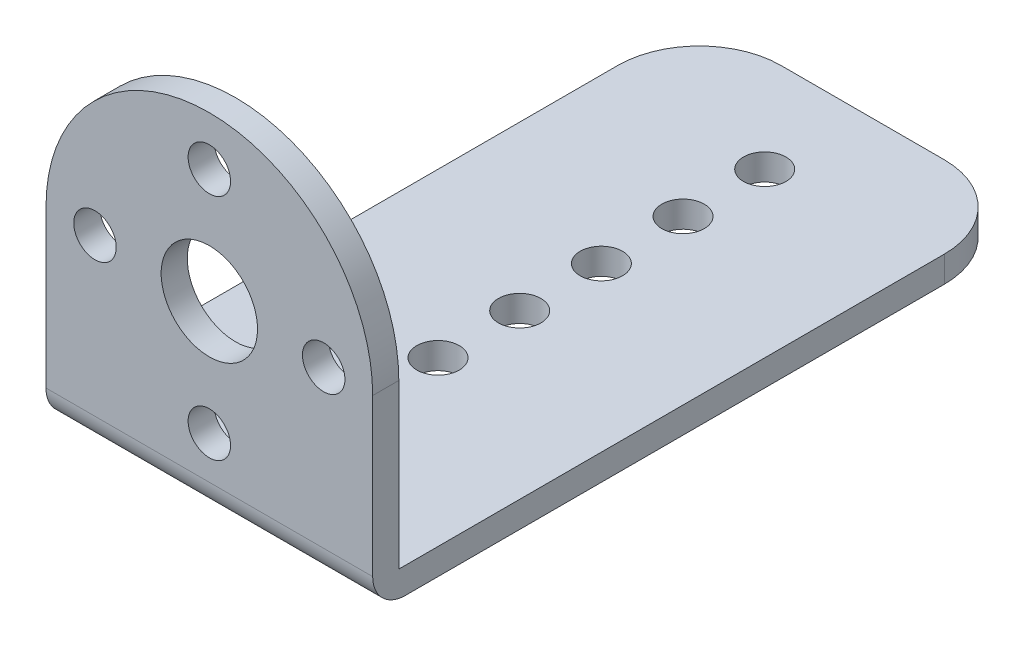
ISO-10303-21;
HEADER;
FILE_DESCRIPTION(('STEP AP214'),'2;1');
FILE_NAME('part.step','',(''),(''),'','','');
FILE_SCHEMA(('AUTOMOTIVE_DESIGN { 1 0 10303 214 1 1 1 1 }'));
ENDSEC;
DATA;
#1=APPLICATION_CONTEXT('core data for automotive mechanical design processes');
#2=APPLICATION_PROTOCOL_DEFINITION('international standard','automotive_design',2000,#1);
#3=PRODUCT_CONTEXT('',#1,'mechanical');
#4=PRODUCT('Part','Part','',(#3));
#5=PRODUCT_RELATED_PRODUCT_CATEGORY('part','',(#4));
#6=PRODUCT_DEFINITION_FORMATION('','',#4);
#7=PRODUCT_DEFINITION_CONTEXT('part definition',#1,'design');
#8=PRODUCT_DEFINITION('design','',#6,#7);
#9=PRODUCT_DEFINITION_SHAPE('','',#8);
#10=(LENGTH_UNIT() NAMED_UNIT(*) SI_UNIT(.MILLI.,.METRE.));
#11=(NAMED_UNIT(*) PLANE_ANGLE_UNIT() SI_UNIT($,.RADIAN.));
#12=(NAMED_UNIT(*) SI_UNIT($,.STERADIAN.) SOLID_ANGLE_UNIT());
#13=UNCERTAINTY_MEASURE_WITH_UNIT(LENGTH_MEASURE(1.E-05),#10,'distance_accuracy_value','');
#14=(GEOMETRIC_REPRESENTATION_CONTEXT(3) GLOBAL_UNCERTAINTY_ASSIGNED_CONTEXT((#13)) GLOBAL_UNIT_ASSIGNED_CONTEXT((#10,
#11,#12)) REPRESENTATION_CONTEXT('',''));
#15=CARTESIAN_POINT('',(0.,0.,0.));
#16=DIRECTION('',(0.,0.,1.));
#17=DIRECTION('',(1.,0.,0.));
#18=AXIS2_PLACEMENT_3D('',#15,#16,#17);
#19=CARTESIAN_POINT('',(0.,0.,-2.032));
#20=DIRECTION('',(0.,0.,1.));
#21=DIRECTION('',(1.,0.,0.));
#22=AXIS2_PLACEMENT_3D('',#19,#20,#21);
#23=PLANE('',#22);
#24=CARTESIAN_POINT('',(0.,0.,-2.032));
#25=DIRECTION('',(0.,0.,1.));
#26=DIRECTION('',(1.,0.,0.));
#27=AXIS2_PLACEMENT_3D('',#24,#25,#26);
#28=CIRCLE('',#27,3.7465);
#29=CARTESIAN_POINT('',(3.7465,0.,-2.032));
#30=VERTEX_POINT('',#29);
#31=EDGE_CURVE('E138',#30,#30,#28,.T.);
#32=ORIENTED_EDGE('',*,*,#31,.T.);
#33=EDGE_LOOP('',(#32));
#34=FACE_BOUND('',#33,.T.);
#35=CARTESIAN_POINT('',(0.,8.89,-2.032));
#36=DIRECTION('',(0.,0.,1.));
#37=DIRECTION('',(1.,0.,0.));
#38=AXIS2_PLACEMENT_3D('',#35,#36,#37);
#39=CIRCLE('',#38,1.651);
#40=CARTESIAN_POINT('',(1.651,8.89,-2.032));
#41=VERTEX_POINT('',#40);
#42=EDGE_CURVE('E285',#41,#41,#39,.T.);
#43=ORIENTED_EDGE('',*,*,#42,.T.);
#44=EDGE_LOOP('',(#43));
#45=FACE_BOUND('',#44,.T.);
#46=CARTESIAN_POINT('',(8.89,0.,-2.032));
#47=DIRECTION('',(0.,0.,1.));
#48=DIRECTION('',(1.,0.,0.));
#49=AXIS2_PLACEMENT_3D('',#46,#47,#48);
#50=CIRCLE('',#49,1.651);
#51=CARTESIAN_POINT('',(10.541,0.,-2.032));
#52=VERTEX_POINT('',#51);
#53=EDGE_CURVE('E290',#52,#52,#50,.T.);
#54=ORIENTED_EDGE('',*,*,#53,.T.);
#55=EDGE_LOOP('',(#54));
#56=FACE_BOUND('',#55,.T.);
#57=CARTESIAN_POINT('',(5.03160571663699E-13,-8.89,-2.032));
#58=DIRECTION('',(0.,0.,1.));
#59=DIRECTION('',(1.,0.,0.));
#60=AXIS2_PLACEMENT_3D('',#57,#58,#59);
#61=CIRCLE('',#60,1.65100000000054);
#62=CARTESIAN_POINT('',(1.65100000000104,-8.89,-2.032));
#63=VERTEX_POINT('',#62);
#64=EDGE_CURVE('E319',#63,#63,#61,.T.);
#65=ORIENTED_EDGE('',*,*,#64,.T.);
#66=EDGE_LOOP('',(#65));
#67=FACE_BOUND('',#66,.T.);
#68=CARTESIAN_POINT('',(-8.89,0.,-2.032));
#69=DIRECTION('',(0.,0.,1.));
#70=DIRECTION('',(1.,0.,0.));
#71=AXIS2_PLACEMENT_3D('',#68,#69,#70);
#72=CIRCLE('',#71,1.651);
#73=CARTESIAN_POINT('',(-7.239,0.,-2.032));
#74=VERTEX_POINT('',#73);
#75=EDGE_CURVE('E314',#74,#74,#72,.T.);
#76=ORIENTED_EDGE('',*,*,#75,.T.);
#77=EDGE_LOOP('',(#76));
#78=FACE_BOUND('',#77,.T.);
#79=DIRECTION('',(1.,0.,0.));
#80=VECTOR('',#79,1.);
#81=CARTESIAN_POINT('',(0.,-12.7,-2.032));
#82=LINE('',#81,#80);
#83=CARTESIAN_POINT('',(-12.7,-12.7,-2.032));
#84=VERTEX_POINT('',#83);
#85=CARTESIAN_POINT('',(12.7,-12.7,-2.032));
#86=VERTEX_POINT('',#85);
#87=EDGE_CURVE('E107',#84,#86,#82,.T.);
#88=ORIENTED_EDGE('',*,*,#87,.F.);
#89=DIRECTION('',(0.,-1.,0.));
#90=VECTOR('',#89,1.);
#91=CARTESIAN_POINT('',(-12.7,0.,-2.032));
#92=LINE('',#91,#90);
#93=CARTESIAN_POINT('',(-12.7,0.,-2.032));
#94=VERTEX_POINT('',#93);
#95=EDGE_CURVE('E118',#94,#84,#92,.T.);
#96=ORIENTED_EDGE('',*,*,#95,.F.);
#97=CARTESIAN_POINT('',(0.,0.,-2.032));
#98=DIRECTION('',(0.,0.,1.));
#99=DIRECTION('',(1.,0.,0.));
#100=AXIS2_PLACEMENT_3D('',#97,#98,#99);
#101=CIRCLE('',#100,12.7);
#102=CARTESIAN_POINT('',(12.7,0.,-2.032));
#103=VERTEX_POINT('',#102);
#104=EDGE_CURVE('E127',#103,#94,#101,.T.);
#105=ORIENTED_EDGE('',*,*,#104,.F.);
#106=DIRECTION('',(0.,1.,0.));
#107=VECTOR('',#106,1.);
#108=CARTESIAN_POINT('',(12.7,0.,-2.032));
#109=LINE('',#108,#107);
#110=EDGE_CURVE('E120',#86,#103,#109,.T.);
#111=ORIENTED_EDGE('',*,*,#110,.F.);
#112=EDGE_LOOP('',(#88,#96,#105,#111));
#113=FACE_BOUND('',#112,.T.);
#114=ADVANCED_FACE('F33',(#34,#45,#56,#67,#78,#113),#23,.F.);
#115=CARTESIAN_POINT('',(0.,0.,-2.032));
#116=DIRECTION('',(0.,0.,1.));
#117=DIRECTION('',(1.,0.,0.));
#118=AXIS2_PLACEMENT_3D('',#115,#116,#117);
#119=CYLINDRICAL_SURFACE('',#118,12.7);
#120=CARTESIAN_POINT('',(0.,0.,0.));
#121=DIRECTION('',(0.,0.,1.));
#122=DIRECTION('',(1.,0.,0.));
#123=AXIS2_PLACEMENT_3D('',#120,#121,#122);
#124=CIRCLE('',#123,12.7);
#125=CARTESIAN_POINT('',(12.7,0.,0.));
#126=VERTEX_POINT('',#125);
#127=CARTESIAN_POINT('',(-12.7,0.,0.));
#128=VERTEX_POINT('',#127);
#129=EDGE_CURVE('E134',#126,#128,#124,.T.);
#130=ORIENTED_EDGE('',*,*,#129,.F.);
#131=DIRECTION('',(0.,0.,1.));
#132=VECTOR('',#131,1.);
#133=CARTESIAN_POINT('',(12.7,0.,-2.032));
#134=LINE('',#133,#132);
#135=EDGE_CURVE('E142',#103,#126,#134,.T.);
#136=ORIENTED_EDGE('',*,*,#135,.F.);
#137=ORIENTED_EDGE('',*,*,#104,.T.);
#138=DIRECTION('',(0.,0.,1.));
#139=VECTOR('',#138,1.);
#140=CARTESIAN_POINT('',(-12.7,0.,-2.032));
#141=LINE('',#140,#139);
#142=EDGE_CURVE('E126',#94,#128,#141,.T.);
#143=ORIENTED_EDGE('',*,*,#142,.T.);
#144=EDGE_LOOP('',(#130,#136,#137,#143));
#145=FACE_BOUND('',#144,.T.);
#146=ADVANCED_FACE('F199',(#145),#119,.T.);
#147=CARTESIAN_POINT('',(12.7,0.,-2.032));
#148=DIRECTION('',(1.,0.,0.));
#149=DIRECTION('',(0.,0.,-1.));
#150=AXIS2_PLACEMENT_3D('',#147,#148,#149);
#151=PLANE('',#150);
#152=DIRECTION('',(0.,0.,1.));
#153=VECTOR('',#152,1.);
#154=CARTESIAN_POINT('',(12.7,-14.732,-2.032));
#155=LINE('',#154,#153);
#156=CARTESIAN_POINT('',(12.7,-14.732,-44.45));
#157=VERTEX_POINT('',#156);
#158=CARTESIAN_POINT('',(12.7,-14.732,-2.54));
#159=VERTEX_POINT('',#158);
#160=EDGE_CURVE('E146',#157,#159,#155,.T.);
#161=ORIENTED_EDGE('',*,*,#160,.F.);
#162=DIRECTION('',(0.,-1.,0.));
#163=VECTOR('',#162,1.);
#164=CARTESIAN_POINT('',(12.7,0.,-44.45));
#165=LINE('',#164,#163);
#166=CARTESIAN_POINT('',(12.7,-12.7,-44.45));
#167=VERTEX_POINT('',#166);
#168=EDGE_CURVE('E56',#157,#167,#165,.F.);
#169=ORIENTED_EDGE('',*,*,#168,.T.);
#170=DIRECTION('',(0.,0.,1.));
#171=VECTOR('',#170,1.);
#172=CARTESIAN_POINT('',(12.7,-12.7,0.));
#173=LINE('',#172,#171);
#174=EDGE_CURVE('E122',#167,#86,#173,.T.);
#175=ORIENTED_EDGE('',*,*,#174,.T.);
#176=ORIENTED_EDGE('',*,*,#110,.T.);
#177=ORIENTED_EDGE('',*,*,#135,.T.);
#178=DIRECTION('',(0.,1.,0.));
#179=VECTOR('',#178,1.);
#180=CARTESIAN_POINT('',(12.7,0.,0.));
#181=LINE('',#180,#179);
#182=CARTESIAN_POINT('',(12.7,-12.192,0.));
#183=VERTEX_POINT('',#182);
#184=EDGE_CURVE('E130',#183,#126,#181,.T.);
#185=ORIENTED_EDGE('',*,*,#184,.F.);
#186=CARTESIAN_POINT('',(12.7,-12.192,-2.54));
#187=DIRECTION('',(1.,0.,0.));
#188=DIRECTION('',(0.,0.,-1.));
#189=AXIS2_PLACEMENT_3D('',#186,#187,#188);
#190=CIRCLE('',#189,2.54);
#191=EDGE_CURVE('E153',#183,#159,#190,.T.);
#192=ORIENTED_EDGE('',*,*,#191,.T.);
#193=EDGE_LOOP('',(#161,#169,#175,#176,#177,#185,#192));
#194=FACE_BOUND('',#193,.T.);
#195=ADVANCED_FACE('F185',(#194),#151,.T.);
#196=CARTESIAN_POINT('',(-12.7,-14.732,-2.032));
#197=DIRECTION('',(0.,-1.,0.));
#198=DIRECTION('',(0.,0.,-1.));
#199=AXIS2_PLACEMENT_3D('',#196,#197,#198);
#200=PLANE('',#199);
#201=DIRECTION('',(1.,0.,0.));
#202=VECTOR('',#201,1.);
#203=CARTESIAN_POINT('',(-12.7,-14.732,-50.8));
#204=LINE('',#203,#202);
#205=CARTESIAN_POINT('',(-6.35,-14.732,-50.8));
#206=VERTEX_POINT('',#205);
#207=CARTESIAN_POINT('',(6.35,-14.732,-50.8));
#208=VERTEX_POINT('',#207);
#209=EDGE_CURVE('E113',#206,#208,#204,.T.);
#210=ORIENTED_EDGE('',*,*,#209,.T.);
#211=CARTESIAN_POINT('',(6.35,-14.732,-44.45));
#212=DIRECTION('',(0.,-1.,0.));
#213=DIRECTION('',(0.,0.,-1.));
#214=AXIS2_PLACEMENT_3D('',#211,#212,#213);
#215=CIRCLE('',#214,6.35);
#216=EDGE_CURVE('E168',#208,#157,#215,.T.);
#217=ORIENTED_EDGE('',*,*,#216,.T.);
#218=ORIENTED_EDGE('',*,*,#160,.T.);
#219=DIRECTION('',(1.,0.,0.));
#220=VECTOR('',#219,1.);
#221=CARTESIAN_POINT('',(-12.7,-14.732,-2.54));
#222=LINE('',#221,#220);
#223=CARTESIAN_POINT('',(-12.7,-14.732,-2.54));
#224=VERTEX_POINT('',#223);
#225=EDGE_CURVE('E156',#159,#224,#222,.F.);
#226=ORIENTED_EDGE('',*,*,#225,.T.);
#227=DIRECTION('',(0.,0.,1.));
#228=VECTOR('',#227,1.);
#229=CARTESIAN_POINT('',(-12.7,-14.732,-2.032));
#230=LINE('',#229,#228);
#231=CARTESIAN_POINT('',(-12.7,-14.732,-44.45));
#232=VERTEX_POINT('',#231);
#233=EDGE_CURVE('E148',#232,#224,#230,.T.);
#234=ORIENTED_EDGE('',*,*,#233,.F.);
#235=CARTESIAN_POINT('',(-6.35,-14.732,-44.45));
#236=DIRECTION('',(0.,-1.,0.));
#237=DIRECTION('',(0.,0.,-1.));
#238=AXIS2_PLACEMENT_3D('',#235,#236,#237);
#239=CIRCLE('',#238,6.35);
#240=EDGE_CURVE('E166',#232,#206,#239,.T.);
#241=ORIENTED_EDGE('',*,*,#240,.T.);
#242=EDGE_LOOP('',(#210,#217,#218,#226,#234,#241));
#243=FACE_BOUND('',#242,.T.);
#244=CARTESIAN_POINT('',(0.,-14.732,-43.18));
#245=DIRECTION('',(0.,-1.,0.));
#246=DIRECTION('',(0.,0.,-1.));
#247=AXIS2_PLACEMENT_3D('',#244,#245,#246);
#248=CIRCLE('',#247,1.651);
#249=CARTESIAN_POINT('',(0.,-14.732,-44.831));
#250=VERTEX_POINT('',#249);
#251=EDGE_CURVE('E332',#250,#250,#248,.T.);
#252=ORIENTED_EDGE('',*,*,#251,.F.);
#253=EDGE_LOOP('',(#252));
#254=FACE_BOUND('',#253,.T.);
#255=CARTESIAN_POINT('',(0.,-14.732,-36.83));
#256=DIRECTION('',(0.,-1.,0.));
#257=DIRECTION('',(0.,0.,-1.));
#258=AXIS2_PLACEMENT_3D('',#255,#256,#257);
#259=CIRCLE('',#258,1.651);
#260=CARTESIAN_POINT('',(0.,-14.732,-38.481));
#261=VERTEX_POINT('',#260);
#262=EDGE_CURVE('E338',#261,#261,#259,.T.);
#263=ORIENTED_EDGE('',*,*,#262,.F.);
#264=EDGE_LOOP('',(#263));
#265=FACE_BOUND('',#264,.T.);
#266=CARTESIAN_POINT('',(0.,-14.732,-30.48));
#267=DIRECTION('',(0.,-1.,0.));
#268=DIRECTION('',(0.,0.,-1.));
#269=AXIS2_PLACEMENT_3D('',#266,#267,#268);
#270=CIRCLE('',#269,1.651);
#271=CARTESIAN_POINT('',(0.,-14.732,-32.131));
#272=VERTEX_POINT('',#271);
#273=EDGE_CURVE('E344',#272,#272,#270,.T.);
#274=ORIENTED_EDGE('',*,*,#273,.F.);
#275=EDGE_LOOP('',(#274));
#276=FACE_BOUND('',#275,.T.);
#277=CARTESIAN_POINT('',(0.,-14.732,-24.13));
#278=DIRECTION('',(0.,-1.,0.));
#279=DIRECTION('',(0.,0.,-1.));
#280=AXIS2_PLACEMENT_3D('',#277,#278,#279);
#281=CIRCLE('',#280,1.651);
#282=CARTESIAN_POINT('',(0.,-14.732,-25.781));
#283=VERTEX_POINT('',#282);
#284=EDGE_CURVE('E350',#283,#283,#281,.T.);
#285=ORIENTED_EDGE('',*,*,#284,.F.);
#286=EDGE_LOOP('',(#285));
#287=FACE_BOUND('',#286,.T.);
#288=CARTESIAN_POINT('',(0.,-14.732,-17.78));
#289=DIRECTION('',(0.,-1.,0.));
#290=DIRECTION('',(0.,0.,-1.));
#291=AXIS2_PLACEMENT_3D('',#288,#289,#290);
#292=CIRCLE('',#291,1.651);
#293=CARTESIAN_POINT('',(0.,-14.732,-19.431));
#294=VERTEX_POINT('',#293);
#295=EDGE_CURVE('E356',#294,#294,#292,.T.);
#296=ORIENTED_EDGE('',*,*,#295,.F.);
#297=EDGE_LOOP('',(#296));
#298=FACE_BOUND('',#297,.T.);
#299=CARTESIAN_POINT('',(0.,-14.732,-11.43));
#300=DIRECTION('',(0.,-1.,0.));
#301=DIRECTION('',(0.,0.,-1.));
#302=AXIS2_PLACEMENT_3D('',#299,#300,#301);
#303=CIRCLE('',#302,1.651);
#304=CARTESIAN_POINT('',(0.,-14.732,-13.081));
#305=VERTEX_POINT('',#304);
#306=EDGE_CURVE('E362',#305,#305,#303,.T.);
#307=ORIENTED_EDGE('',*,*,#306,.F.);
#308=EDGE_LOOP('',(#307));
#309=FACE_BOUND('',#308,.T.);
#310=CARTESIAN_POINT('',(-1.02180915128385E-13,-14.732,-5.07999999999999));
#311=DIRECTION('',(0.,-1.,0.));
#312=DIRECTION('',(0.,0.,-1.));
#313=AXIS2_PLACEMENT_3D('',#310,#311,#312);
#314=CIRCLE('',#313,1.651);
#315=CARTESIAN_POINT('',(-1.02180915128385E-13,-14.732,-6.73099999999999));
#316=VERTEX_POINT('',#315);
#317=EDGE_CURVE('E368',#316,#316,#314,.T.);
#318=ORIENTED_EDGE('',*,*,#317,.F.);
#319=EDGE_LOOP('',(#318));
#320=FACE_BOUND('',#319,.T.);
#321=ADVANCED_FACE('F183',(#243,#254,#265,#276,#287,#298,#309,#320),#200,.T.);
#322=CARTESIAN_POINT('',(-12.7,0.,-2.032));
#323=DIRECTION('',(-1.,0.,0.));
#324=DIRECTION('',(0.,-1.,0.));
#325=AXIS2_PLACEMENT_3D('',#322,#323,#324);
#326=PLANE('',#325);
#327=DIRECTION('',(0.,0.,-1.));
#328=VECTOR('',#327,1.);
#329=CARTESIAN_POINT('',(-12.7,-12.7,0.));
#330=LINE('',#329,#328);
#331=CARTESIAN_POINT('',(-12.7,-12.7,-44.45));
#332=VERTEX_POINT('',#331);
#333=EDGE_CURVE('E104',#84,#332,#330,.T.);
#334=ORIENTED_EDGE('',*,*,#333,.T.);
#335=DIRECTION('',(0.,-1.,0.));
#336=VECTOR('',#335,1.);
#337=CARTESIAN_POINT('',(-12.7,0.,-44.45));
#338=LINE('',#337,#336);
#339=EDGE_CURVE('E11',#332,#232,#338,.T.);
#340=ORIENTED_EDGE('',*,*,#339,.T.);
#341=ORIENTED_EDGE('',*,*,#233,.T.);
#342=CARTESIAN_POINT('',(-12.7,-12.192,-2.54));
#343=DIRECTION('',(-1.,0.,0.));
#344=DIRECTION('',(0.,-1.,0.));
#345=AXIS2_PLACEMENT_3D('',#342,#343,#344);
#346=CIRCLE('',#345,2.54);
#347=CARTESIAN_POINT('',(-12.7,-12.192,0.));
#348=VERTEX_POINT('',#347);
#349=EDGE_CURVE('E159',#224,#348,#346,.T.);
#350=ORIENTED_EDGE('',*,*,#349,.T.);
#351=DIRECTION('',(0.,-1.,0.));
#352=VECTOR('',#351,1.);
#353=CARTESIAN_POINT('',(-12.7,0.,0.));
#354=LINE('',#353,#352);
#355=EDGE_CURVE('E137',#128,#348,#354,.T.);
#356=ORIENTED_EDGE('',*,*,#355,.F.);
#357=ORIENTED_EDGE('',*,*,#142,.F.);
#358=ORIENTED_EDGE('',*,*,#95,.T.);
#359=EDGE_LOOP('',(#334,#340,#341,#350,#356,#357,#358));
#360=FACE_BOUND('',#359,.T.);
#361=ADVANCED_FACE('F124',(#360),#326,.T.);
#362=CARTESIAN_POINT('',(0.,0.,0.));
#363=DIRECTION('',(0.,0.,1.));
#364=DIRECTION('',(1.,0.,0.));
#365=AXIS2_PLACEMENT_3D('',#362,#363,#364);
#366=PLANE('',#365);
#367=ORIENTED_EDGE('',*,*,#355,.T.);
#368=DIRECTION('',(1.,0.,0.));
#369=VECTOR('',#368,1.);
#370=CARTESIAN_POINT('',(0.,-12.192,0.));
#371=LINE('',#370,#369);
#372=EDGE_CURVE('E145',#348,#183,#371,.T.);
#373=ORIENTED_EDGE('',*,*,#372,.T.);
#374=ORIENTED_EDGE('',*,*,#184,.T.);
#375=ORIENTED_EDGE('',*,*,#129,.T.);
#376=EDGE_LOOP('',(#367,#373,#374,#375));
#377=FACE_BOUND('',#376,.T.);
#378=CARTESIAN_POINT('',(0.,0.,0.));
#379=DIRECTION('',(0.,0.,1.));
#380=DIRECTION('',(1.,0.,0.));
#381=AXIS2_PLACEMENT_3D('',#378,#379,#380);
#382=CIRCLE('',#381,3.7465);
#383=CARTESIAN_POINT('',(3.7465,0.,0.));
#384=VERTEX_POINT('',#383);
#385=EDGE_CURVE('E292',#384,#384,#382,.T.);
#386=ORIENTED_EDGE('',*,*,#385,.F.);
#387=EDGE_LOOP('',(#386));
#388=FACE_BOUND('',#387,.T.);
#389=CARTESIAN_POINT('',(0.,8.89,0.));
#390=DIRECTION('',(0.,0.,1.));
#391=DIRECTION('',(1.,0.,0.));
#392=AXIS2_PLACEMENT_3D('',#389,#390,#391);
#393=CIRCLE('',#392,1.651);
#394=CARTESIAN_POINT('',(1.651,8.89,0.));
#395=VERTEX_POINT('',#394);
#396=EDGE_CURVE('E288',#395,#395,#393,.T.);
#397=ORIENTED_EDGE('',*,*,#396,.F.);
#398=EDGE_LOOP('',(#397));
#399=FACE_BOUND('',#398,.T.);
#400=CARTESIAN_POINT('',(8.89,0.,0.));
#401=DIRECTION('',(0.,0.,1.));
#402=DIRECTION('',(1.,0.,0.));
#403=AXIS2_PLACEMENT_3D('',#400,#401,#402);
#404=CIRCLE('',#403,1.651);
#405=CARTESIAN_POINT('',(10.541,0.,0.));
#406=VERTEX_POINT('',#405);
#407=EDGE_CURVE('E295',#406,#406,#404,.T.);
#408=ORIENTED_EDGE('',*,*,#407,.F.);
#409=EDGE_LOOP('',(#408));
#410=FACE_BOUND('',#409,.T.);
#411=CARTESIAN_POINT('',(5.03160571663699E-13,-8.89,0.));
#412=DIRECTION('',(0.,0.,1.));
#413=DIRECTION('',(1.,0.,0.));
#414=AXIS2_PLACEMENT_3D('',#411,#412,#413);
#415=CIRCLE('',#414,1.65100000000054);
#416=CARTESIAN_POINT('',(1.65100000000104,-8.89,0.));
#417=VERTEX_POINT('',#416);
#418=EDGE_CURVE('E310',#417,#417,#415,.T.);
#419=ORIENTED_EDGE('',*,*,#418,.F.);
#420=EDGE_LOOP('',(#419));
#421=FACE_BOUND('',#420,.T.);
#422=CARTESIAN_POINT('',(-8.89,0.,0.));
#423=DIRECTION('',(0.,0.,1.));
#424=DIRECTION('',(1.,0.,0.));
#425=AXIS2_PLACEMENT_3D('',#422,#423,#424);
#426=CIRCLE('',#425,1.651);
#427=CARTESIAN_POINT('',(-7.239,0.,0.));
#428=VERTEX_POINT('',#427);
#429=EDGE_CURVE('E121',#428,#428,#426,.T.);
#430=ORIENTED_EDGE('',*,*,#429,.F.);
#431=EDGE_LOOP('',(#430));
#432=FACE_BOUND('',#431,.T.);
#433=ADVANCED_FACE('F213',(#377,#388,#399,#410,#421,#432),#366,.T.);
#434=CARTESIAN_POINT('',(0.,0.,-2.032));
#435=DIRECTION('',(0.,0.,1.));
#436=DIRECTION('',(1.,0.,0.));
#437=AXIS2_PLACEMENT_3D('',#434,#435,#436);
#438=CYLINDRICAL_SURFACE('',#437,3.7465);
#439=ORIENTED_EDGE('',*,*,#31,.F.);
#440=EDGE_LOOP('',(#439));
#441=FACE_BOUND('',#440,.T.);
#442=ORIENTED_EDGE('',*,*,#385,.T.);
#443=EDGE_LOOP('',(#442));
#444=FACE_BOUND('',#443,.T.);
#445=ADVANCED_FACE('F211',(#441,#444),#438,.F.);
#446=CARTESIAN_POINT('',(0.,8.89,-2.032));
#447=DIRECTION('',(0.,0.,1.));
#448=DIRECTION('',(1.,0.,0.));
#449=AXIS2_PLACEMENT_3D('',#446,#447,#448);
#450=CYLINDRICAL_SURFACE('',#449,1.651);
#451=ORIENTED_EDGE('',*,*,#42,.F.);
#452=EDGE_LOOP('',(#451));
#453=FACE_BOUND('',#452,.T.);
#454=ORIENTED_EDGE('',*,*,#396,.T.);
#455=EDGE_LOOP('',(#454));
#456=FACE_BOUND('',#455,.T.);
#457=ADVANCED_FACE('F274',(#453,#456),#450,.F.);
#458=CARTESIAN_POINT('',(8.89,0.,-2.032));
#459=DIRECTION('',(0.,0.,1.));
#460=DIRECTION('',(1.,0.,0.));
#461=AXIS2_PLACEMENT_3D('',#458,#459,#460);
#462=CYLINDRICAL_SURFACE('',#461,1.651);
#463=ORIENTED_EDGE('',*,*,#53,.F.);
#464=EDGE_LOOP('',(#463));
#465=FACE_BOUND('',#464,.T.);
#466=ORIENTED_EDGE('',*,*,#407,.T.);
#467=EDGE_LOOP('',(#466));
#468=FACE_BOUND('',#467,.T.);
#469=ADVANCED_FACE('F271',(#465,#468),#462,.F.);
#470=CARTESIAN_POINT('',(5.03160571663699E-13,-8.89,-2.032));
#471=DIRECTION('',(0.,0.,1.));
#472=DIRECTION('',(1.,0.,0.));
#473=AXIS2_PLACEMENT_3D('',#470,#471,#472);
#474=CYLINDRICAL_SURFACE('',#473,1.65100000000054);
#475=ORIENTED_EDGE('',*,*,#64,.F.);
#476=EDGE_LOOP('',(#475));
#477=FACE_BOUND('',#476,.T.);
#478=ORIENTED_EDGE('',*,*,#418,.T.);
#479=EDGE_LOOP('',(#478));
#480=FACE_BOUND('',#479,.T.);
#481=ADVANCED_FACE('F267',(#477,#480),#474,.F.);
#482=CARTESIAN_POINT('',(-8.89,0.,-2.032));
#483=DIRECTION('',(0.,0.,1.));
#484=DIRECTION('',(1.,0.,0.));
#485=AXIS2_PLACEMENT_3D('',#482,#483,#484);
#486=CYLINDRICAL_SURFACE('',#485,1.651);
#487=ORIENTED_EDGE('',*,*,#75,.F.);
#488=EDGE_LOOP('',(#487));
#489=FACE_BOUND('',#488,.T.);
#490=ORIENTED_EDGE('',*,*,#429,.T.);
#491=EDGE_LOOP('',(#490));
#492=FACE_BOUND('',#491,.T.);
#493=ADVANCED_FACE('F261',(#489,#492),#486,.F.);
#494=CARTESIAN_POINT('',(0.,-12.7,0.));
#495=DIRECTION('',(0.,-1.,0.));
#496=DIRECTION('',(0.,0.,-1.));
#497=AXIS2_PLACEMENT_3D('',#494,#495,#496);
#498=PLANE('',#497);
#499=CARTESIAN_POINT('',(0.,-12.7,-43.18));
#500=DIRECTION('',(0.,-1.,0.));
#501=DIRECTION('',(0.,0.,-1.));
#502=AXIS2_PLACEMENT_3D('',#499,#500,#501);
#503=CIRCLE('',#502,1.651);
#504=CARTESIAN_POINT('',(0.,-12.7,-44.831));
#505=VERTEX_POINT('',#504);
#506=EDGE_CURVE('E330',#505,#505,#503,.T.);
#507=ORIENTED_EDGE('',*,*,#506,.T.);
#508=EDGE_LOOP('',(#507));
#509=FACE_BOUND('',#508,.T.);
#510=CARTESIAN_POINT('',(0.,-12.7,-36.83));
#511=DIRECTION('',(0.,-1.,0.));
#512=DIRECTION('',(0.,0.,-1.));
#513=AXIS2_PLACEMENT_3D('',#510,#511,#512);
#514=CIRCLE('',#513,1.651);
#515=CARTESIAN_POINT('',(0.,-12.7,-38.481));
#516=VERTEX_POINT('',#515);
#517=EDGE_CURVE('E335',#516,#516,#514,.T.);
#518=ORIENTED_EDGE('',*,*,#517,.T.);
#519=EDGE_LOOP('',(#518));
#520=FACE_BOUND('',#519,.T.);
#521=CARTESIAN_POINT('',(0.,-12.7,-30.48));
#522=DIRECTION('',(0.,-1.,0.));
#523=DIRECTION('',(0.,0.,-1.));
#524=AXIS2_PLACEMENT_3D('',#521,#522,#523);
#525=CIRCLE('',#524,1.651);
#526=CARTESIAN_POINT('',(0.,-12.7,-32.131));
#527=VERTEX_POINT('',#526);
#528=EDGE_CURVE('E341',#527,#527,#525,.T.);
#529=ORIENTED_EDGE('',*,*,#528,.T.);
#530=EDGE_LOOP('',(#529));
#531=FACE_BOUND('',#530,.T.);
#532=CARTESIAN_POINT('',(0.,-12.7,-24.13));
#533=DIRECTION('',(0.,-1.,0.));
#534=DIRECTION('',(0.,0.,-1.));
#535=AXIS2_PLACEMENT_3D('',#532,#533,#534);
#536=CIRCLE('',#535,1.651);
#537=CARTESIAN_POINT('',(0.,-12.7,-25.781));
#538=VERTEX_POINT('',#537);
#539=EDGE_CURVE('E347',#538,#538,#536,.T.);
#540=ORIENTED_EDGE('',*,*,#539,.T.);
#541=EDGE_LOOP('',(#540));
#542=FACE_BOUND('',#541,.T.);
#543=CARTESIAN_POINT('',(0.,-12.7,-17.78));
#544=DIRECTION('',(0.,-1.,0.));
#545=DIRECTION('',(0.,0.,-1.));
#546=AXIS2_PLACEMENT_3D('',#543,#544,#545);
#547=CIRCLE('',#546,1.651);
#548=CARTESIAN_POINT('',(0.,-12.7,-19.431));
#549=VERTEX_POINT('',#548);
#550=EDGE_CURVE('E353',#549,#549,#547,.T.);
#551=ORIENTED_EDGE('',*,*,#550,.T.);
#552=EDGE_LOOP('',(#551));
#553=FACE_BOUND('',#552,.T.);
#554=CARTESIAN_POINT('',(0.,-12.7,-11.43));
#555=DIRECTION('',(0.,-1.,0.));
#556=DIRECTION('',(0.,0.,-1.));
#557=AXIS2_PLACEMENT_3D('',#554,#555,#556);
#558=CIRCLE('',#557,1.651);
#559=CARTESIAN_POINT('',(0.,-12.7,-13.081));
#560=VERTEX_POINT('',#559);
#561=EDGE_CURVE('E359',#560,#560,#558,.T.);
#562=ORIENTED_EDGE('',*,*,#561,.T.);
#563=EDGE_LOOP('',(#562));
#564=FACE_BOUND('',#563,.T.);
#565=CARTESIAN_POINT('',(-1.02180915128385E-13,-12.7,-5.07999999999999));
#566=DIRECTION('',(0.,-1.,0.));
#567=DIRECTION('',(0.,0.,-1.));
#568=AXIS2_PLACEMENT_3D('',#565,#566,#567);
#569=CIRCLE('',#568,1.651);
#570=CARTESIAN_POINT('',(-1.02180915128385E-13,-12.7,-6.73099999999999));
#571=VERTEX_POINT('',#570);
#572=EDGE_CURVE('E365',#571,#571,#569,.T.);
#573=ORIENTED_EDGE('',*,*,#572,.T.);
#574=EDGE_LOOP('',(#573));
#575=FACE_BOUND('',#574,.T.);
#576=ORIENTED_EDGE('',*,*,#174,.F.);
#577=CARTESIAN_POINT('',(6.35,-12.7,-44.45));
#578=DIRECTION('',(0.,-1.,0.));
#579=DIRECTION('',(0.,0.,-1.));
#580=AXIS2_PLACEMENT_3D('',#577,#578,#579);
#581=CIRCLE('',#580,6.35);
#582=CARTESIAN_POINT('',(6.35,-12.7,-50.8));
#583=VERTEX_POINT('',#582);
#584=EDGE_CURVE('E41',#167,#583,#581,.F.);
#585=ORIENTED_EDGE('',*,*,#584,.T.);
#586=DIRECTION('',(1.,0.,0.));
#587=VECTOR('',#586,1.);
#588=CARTESIAN_POINT('',(-12.7,-12.7,-50.8));
#589=LINE('',#588,#587);
#590=CARTESIAN_POINT('',(-6.35,-12.7,-50.8));
#591=VERTEX_POINT('',#590);
#592=EDGE_CURVE('E112',#591,#583,#589,.T.);
#593=ORIENTED_EDGE('',*,*,#592,.F.);
#594=CARTESIAN_POINT('',(-6.35,-12.7,-44.45));
#595=DIRECTION('',(0.,-1.,0.));
#596=DIRECTION('',(0.,0.,-1.));
#597=AXIS2_PLACEMENT_3D('',#594,#595,#596);
#598=CIRCLE('',#597,6.35);
#599=EDGE_CURVE('E48',#591,#332,#598,.F.);
#600=ORIENTED_EDGE('',*,*,#599,.T.);
#601=ORIENTED_EDGE('',*,*,#333,.F.);
#602=ORIENTED_EDGE('',*,*,#87,.T.);
#603=EDGE_LOOP('',(#576,#585,#593,#600,#601,#602));
#604=FACE_BOUND('',#603,.T.);
#605=ADVANCED_FACE('F106',(#509,#520,#531,#542,#553,#564,#575,#604),#498,.F.);
#606=CARTESIAN_POINT('',(-12.7,-12.7,-50.8));
#607=DIRECTION('',(0.,0.,-1.));
#608=DIRECTION('',(-1.,0.,0.));
#609=AXIS2_PLACEMENT_3D('',#606,#607,#608);
#610=PLANE('',#609);
#611=ORIENTED_EDGE('',*,*,#592,.T.);
#612=DIRECTION('',(0.,-1.,0.));
#613=VECTOR('',#612,1.);
#614=CARTESIAN_POINT('',(6.35,-12.7,-50.8));
#615=LINE('',#614,#613);
#616=EDGE_CURVE('E163',#583,#208,#615,.T.);
#617=ORIENTED_EDGE('',*,*,#616,.T.);
#618=ORIENTED_EDGE('',*,*,#209,.F.);
#619=DIRECTION('',(0.,-1.,0.));
#620=VECTOR('',#619,1.);
#621=CARTESIAN_POINT('',(-6.35,-12.7,-50.8));
#622=LINE('',#621,#620);
#623=EDGE_CURVE('E161',#206,#591,#622,.F.);
#624=ORIENTED_EDGE('',*,*,#623,.T.);
#625=EDGE_LOOP('',(#611,#617,#618,#624));
#626=FACE_BOUND('',#625,.T.);
#627=ADVANCED_FACE('F176',(#626),#610,.T.);
#628=CARTESIAN_POINT('',(0.,-12.7,-43.18));
#629=DIRECTION('',(0.,-1.,0.));
#630=DIRECTION('',(0.,0.,-1.));
#631=AXIS2_PLACEMENT_3D('',#628,#629,#630);
#632=CYLINDRICAL_SURFACE('',#631,1.651);
#633=ORIENTED_EDGE('',*,*,#506,.F.);
#634=EDGE_LOOP('',(#633));
#635=FACE_BOUND('',#634,.T.);
#636=ORIENTED_EDGE('',*,*,#251,.T.);
#637=EDGE_LOOP('',(#636));
#638=FACE_BOUND('',#637,.T.);
#639=ADVANCED_FACE('F254',(#635,#638),#632,.F.);
#640=CARTESIAN_POINT('',(0.,-12.7,-36.83));
#641=DIRECTION('',(0.,-1.,0.));
#642=DIRECTION('',(0.,0.,-1.));
#643=AXIS2_PLACEMENT_3D('',#640,#641,#642);
#644=CYLINDRICAL_SURFACE('',#643,1.651);
#645=ORIENTED_EDGE('',*,*,#517,.F.);
#646=EDGE_LOOP('',(#645));
#647=FACE_BOUND('',#646,.T.);
#648=ORIENTED_EDGE('',*,*,#262,.T.);
#649=EDGE_LOOP('',(#648));
#650=FACE_BOUND('',#649,.T.);
#651=ADVANCED_FACE('F250',(#647,#650),#644,.F.);
#652=CARTESIAN_POINT('',(0.,-12.7,-30.48));
#653=DIRECTION('',(0.,-1.,0.));
#654=DIRECTION('',(0.,0.,-1.));
#655=AXIS2_PLACEMENT_3D('',#652,#653,#654);
#656=CYLINDRICAL_SURFACE('',#655,1.651);
#657=ORIENTED_EDGE('',*,*,#528,.F.);
#658=EDGE_LOOP('',(#657));
#659=FACE_BOUND('',#658,.T.);
#660=ORIENTED_EDGE('',*,*,#273,.T.);
#661=EDGE_LOOP('',(#660));
#662=FACE_BOUND('',#661,.T.);
#663=ADVANCED_FACE('F246',(#659,#662),#656,.F.);
#664=CARTESIAN_POINT('',(0.,-12.7,-24.13));
#665=DIRECTION('',(0.,-1.,0.));
#666=DIRECTION('',(0.,0.,-1.));
#667=AXIS2_PLACEMENT_3D('',#664,#665,#666);
#668=CYLINDRICAL_SURFACE('',#667,1.651);
#669=ORIENTED_EDGE('',*,*,#539,.F.);
#670=EDGE_LOOP('',(#669));
#671=FACE_BOUND('',#670,.T.);
#672=ORIENTED_EDGE('',*,*,#284,.T.);
#673=EDGE_LOOP('',(#672));
#674=FACE_BOUND('',#673,.T.);
#675=ADVANCED_FACE('F242',(#671,#674),#668,.F.);
#676=CARTESIAN_POINT('',(0.,-12.7,-17.78));
#677=DIRECTION('',(0.,-1.,0.));
#678=DIRECTION('',(0.,0.,-1.));
#679=AXIS2_PLACEMENT_3D('',#676,#677,#678);
#680=CYLINDRICAL_SURFACE('',#679,1.651);
#681=ORIENTED_EDGE('',*,*,#550,.F.);
#682=EDGE_LOOP('',(#681));
#683=FACE_BOUND('',#682,.T.);
#684=ORIENTED_EDGE('',*,*,#295,.T.);
#685=EDGE_LOOP('',(#684));
#686=FACE_BOUND('',#685,.T.);
#687=ADVANCED_FACE('F234',(#683,#686),#680,.F.);
#688=CARTESIAN_POINT('',(0.,-12.7,-11.43));
#689=DIRECTION('',(0.,-1.,0.));
#690=DIRECTION('',(0.,0.,-1.));
#691=AXIS2_PLACEMENT_3D('',#688,#689,#690);
#692=CYLINDRICAL_SURFACE('',#691,1.651);
#693=ORIENTED_EDGE('',*,*,#561,.F.);
#694=EDGE_LOOP('',(#693));
#695=FACE_BOUND('',#694,.T.);
#696=ORIENTED_EDGE('',*,*,#306,.T.);
#697=EDGE_LOOP('',(#696));
#698=FACE_BOUND('',#697,.T.);
#699=ADVANCED_FACE('F228',(#695,#698),#692,.F.);
#700=CARTESIAN_POINT('',(-1.02180915128385E-13,-12.7,-5.07999999999999));
#701=DIRECTION('',(0.,-1.,0.));
#702=DIRECTION('',(0.,0.,-1.));
#703=AXIS2_PLACEMENT_3D('',#700,#701,#702);
#704=CYLINDRICAL_SURFACE('',#703,1.651);
#705=ORIENTED_EDGE('',*,*,#572,.F.);
#706=EDGE_LOOP('',(#705));
#707=FACE_BOUND('',#706,.T.);
#708=ORIENTED_EDGE('',*,*,#317,.T.);
#709=EDGE_LOOP('',(#708));
#710=FACE_BOUND('',#709,.T.);
#711=ADVANCED_FACE('F224',(#707,#710),#704,.F.);
#712=CARTESIAN_POINT('',(0.,-12.192,-2.54));
#713=DIRECTION('',(1.,0.,0.));
#714=DIRECTION('',(0.,0.,-1.));
#715=AXIS2_PLACEMENT_3D('',#712,#713,#714);
#716=CYLINDRICAL_SURFACE('',#715,2.54);
#717=ORIENTED_EDGE('',*,*,#349,.F.);
#718=ORIENTED_EDGE('',*,*,#225,.F.);
#719=ORIENTED_EDGE('',*,*,#191,.F.);
#720=ORIENTED_EDGE('',*,*,#372,.F.);
#721=EDGE_LOOP('',(#717,#718,#719,#720));
#722=FACE_BOUND('',#721,.T.);
#723=ADVANCED_FACE('F191',(#722),#716,.T.);
#724=CARTESIAN_POINT('',(6.35,-12.7,-44.45));
#725=DIRECTION('',(0.,-1.,0.));
#726=DIRECTION('',(0.,0.,-1.));
#727=AXIS2_PLACEMENT_3D('',#724,#725,#726);
#728=CYLINDRICAL_SURFACE('',#727,6.35);
#729=ORIENTED_EDGE('',*,*,#584,.F.);
#730=ORIENTED_EDGE('',*,*,#168,.F.);
#731=ORIENTED_EDGE('',*,*,#216,.F.);
#732=ORIENTED_EDGE('',*,*,#616,.F.);
#733=EDGE_LOOP('',(#729,#730,#731,#732));
#734=FACE_BOUND('',#733,.T.);
#735=ADVANCED_FACE('F181',(#734),#728,.T.);
#736=CARTESIAN_POINT('',(-6.35,0.,-44.45));
#737=DIRECTION('',(0.,-1.,0.));
#738=DIRECTION('',(1.,0.,0.));
#739=AXIS2_PLACEMENT_3D('',#736,#737,#738);
#740=CYLINDRICAL_SURFACE('',#739,6.35);
#741=ORIENTED_EDGE('',*,*,#599,.F.);
#742=ORIENTED_EDGE('',*,*,#623,.F.);
#743=ORIENTED_EDGE('',*,*,#240,.F.);
#744=ORIENTED_EDGE('',*,*,#339,.F.);
#745=EDGE_LOOP('',(#741,#742,#743,#744));
#746=FACE_BOUND('',#745,.T.);
#747=ADVANCED_FACE('F35',(#746),#740,.T.);
#748=CLOSED_SHELL('',(#114,#146,#195,#321,#361,#433,#445,#457,#469,#481,#493,#605,#627,#639,
#651,#663,#675,#687,#699,#711,#723,#735,#747));
#749=MANIFOLD_SOLID_BREP('B2',#748);
#750=ADVANCED_BREP_SHAPE_REPRESENTATION('',(#18,#749),#14);
#751=SHAPE_DEFINITION_REPRESENTATION(#9,#750);
ENDSEC;
END-ISO-10303-21;
